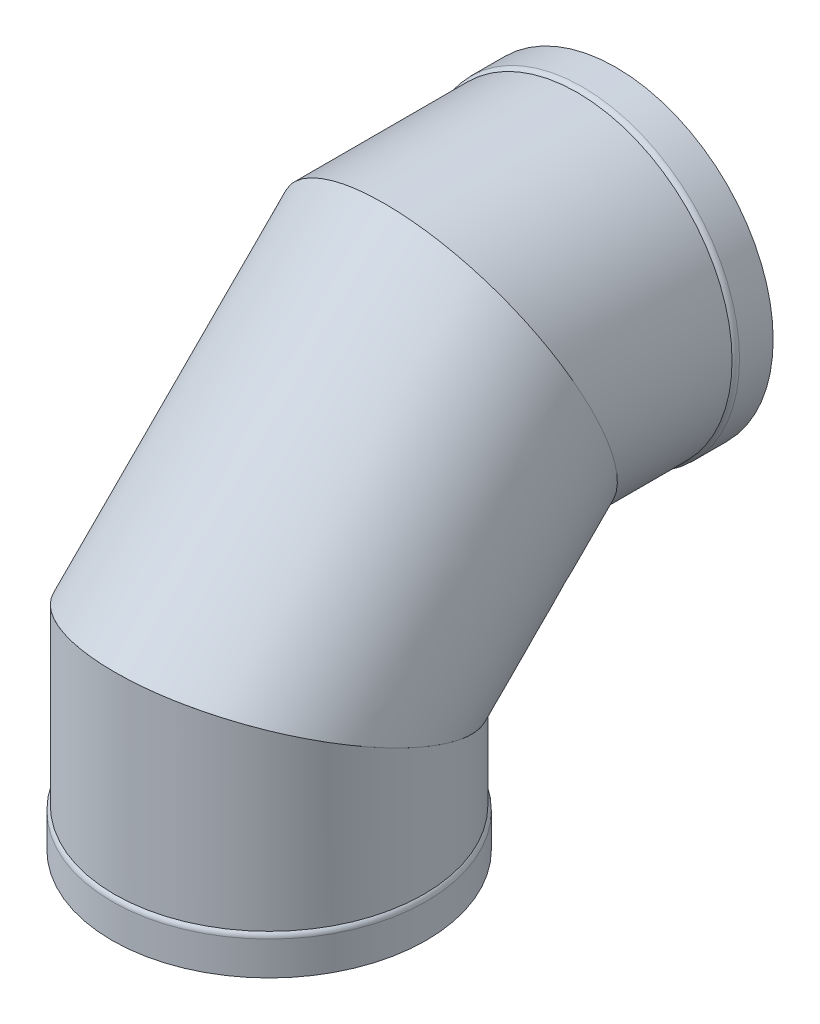
ISO-10303-21;
HEADER;
FILE_DESCRIPTION(('STEP AP214'),'2;1');
FILE_NAME('part.step','',(''),(''),'','','');
FILE_SCHEMA(('AUTOMOTIVE_DESIGN { 1 0 10303 214 1 1 1 1 }'));
ENDSEC;
DATA;
#1=APPLICATION_CONTEXT('core data for automotive mechanical design processes');
#2=APPLICATION_PROTOCOL_DEFINITION('international standard','automotive_design',2000,#1);
#3=PRODUCT_CONTEXT('',#1,'mechanical');
#4=PRODUCT('Part','Part','',(#3));
#5=PRODUCT_RELATED_PRODUCT_CATEGORY('part','',(#4));
#6=PRODUCT_DEFINITION_FORMATION('','',#4);
#7=PRODUCT_DEFINITION_CONTEXT('part definition',#1,'design');
#8=PRODUCT_DEFINITION('design','',#6,#7);
#9=PRODUCT_DEFINITION_SHAPE('','',#8);
#10=(LENGTH_UNIT() NAMED_UNIT(*) SI_UNIT(.MILLI.,.METRE.));
#11=(NAMED_UNIT(*) PLANE_ANGLE_UNIT() SI_UNIT($,.RADIAN.));
#12=(NAMED_UNIT(*) SI_UNIT($,.STERADIAN.) SOLID_ANGLE_UNIT());
#13=UNCERTAINTY_MEASURE_WITH_UNIT(LENGTH_MEASURE(1.E-05),#10,'distance_accuracy_value','');
#14=(GEOMETRIC_REPRESENTATION_CONTEXT(3) GLOBAL_UNCERTAINTY_ASSIGNED_CONTEXT((#13)) GLOBAL_UNIT_ASSIGNED_CONTEXT((#10,
#11,#12)) REPRESENTATION_CONTEXT('',''));
#15=CARTESIAN_POINT('',(0.,0.,0.));
#16=DIRECTION('',(0.,0.,1.));
#17=DIRECTION('',(1.,0.,0.));
#18=AXIS2_PLACEMENT_3D('',#15,#16,#17);
#19=CARTESIAN_POINT('',(0.,683.306549559583,-355.487799559582));
#20=DIRECTION('',(0.,-0.386660790118356,0.922222008729486));
#21=DIRECTION('',(0.,-0.922222008729486,-0.386660790118356));
#22=AXIS2_PLACEMENT_3D('',#19,#20,#21);
#23=PLANE('',#22);
#24=CARTESIAN_POINT('',(0.,683.306549559583,-355.487799559582));
#25=DIRECTION('',(0.,-0.386660790118356,0.922222008729486));
#26=DIRECTION('',(0.,-0.922222008729486,-0.386660790118356));
#27=AXIS2_PLACEMENT_3D('',#24,#25,#26);
#28=ELLIPSE('',#27,325.341942785936,300.0375);
#29=CARTESIAN_POINT('',(0.,383.269049559584,-481.284772215833));
#30=VERTEX_POINT('',#29);
#31=EDGE_CURVE('E90',#30,#30,#28,.T.);
#32=ORIENTED_EDGE('',*,*,#31,.T.);
#33=EDGE_LOOP('',(#32));
#34=FACE_BOUND('',#33,.T.);
#35=CARTESIAN_POINT('',(0.,683.306549559583,-355.487799559582));
#36=DIRECTION('',(0.,-0.386660790118356,0.922222008729486));
#37=DIRECTION('',(0.,-0.922222008729486,-0.386660790118356));
#38=AXIS2_PLACEMENT_3D('',#35,#36,#37);
#39=ELLIPSE('',#38,330.506100607935,304.8);
#40=CARTESIAN_POINT('',(0.,378.506549559584,-483.281549559583));
#41=VERTEX_POINT('',#40);
#42=EDGE_CURVE('E12',#41,#41,#39,.T.);
#43=ORIENTED_EDGE('',*,*,#42,.F.);
#44=EDGE_LOOP('',(#43));
#45=FACE_BOUND('',#44,.T.);
#46=ADVANCED_FACE('F73',(#34,#45),#23,.F.);
#47=CARTESIAN_POINT('',(0.,327.81875,0.));
#48=DIRECTION('',(0.,0.922222008729488,-0.386660790118353));
#49=DIRECTION('',(0.,0.386660790118353,0.922222008729488));
#50=AXIS2_PLACEMENT_3D('',#47,#48,#49);
#51=PLANE('',#50);
#52=CARTESIAN_POINT('',(0.,327.81875,0.));
#53=DIRECTION('',(0.,0.922222008729488,-0.386660790118353));
#54=DIRECTION('',(0.,-0.386660790118353,-0.922222008729488));
#55=AXIS2_PLACEMENT_3D('',#52,#53,#54);
#56=ELLIPSE('',#55,325.341942785936,300.0375);
#57=CARTESIAN_POINT('',(0.,202.02177734375,-300.0375));
#58=VERTEX_POINT('',#57);
#59=EDGE_CURVE('E104',#58,#58,#56,.T.);
#60=ORIENTED_EDGE('',*,*,#59,.T.);
#61=EDGE_LOOP('',(#60));
#62=FACE_BOUND('',#61,.T.);
#63=CARTESIAN_POINT('',(0.,327.81875,0.));
#64=DIRECTION('',(0.,0.922222008729488,-0.386660790118353));
#65=DIRECTION('',(0.,-0.386660790118353,-0.922222008729488));
#66=AXIS2_PLACEMENT_3D('',#63,#64,#65);
#67=ELLIPSE('',#66,330.506100607935,304.8);
#68=CARTESIAN_POINT('',(0.,200.025,-304.8));
#69=VERTEX_POINT('',#68);
#70=EDGE_CURVE('E82',#69,#69,#67,.T.);
#71=ORIENTED_EDGE('',*,*,#70,.F.);
#72=EDGE_LOOP('',(#71));
#73=FACE_BOUND('',#72,.T.);
#74=ADVANCED_FACE('F112',(#62,#73),#51,.F.);
#75=CARTESIAN_POINT('',(0.0381953964425871,455.612498996605,304.799997606811));
#76=CARTESIAN_POINT('',(0.122755309676878,988.106524840313,-227.69405992365));
#77=CARTESIAN_POINT('',(609.638190610064,455.580470565214,304.723606813925));
#78=CARTESIAN_POINT('',(609.722705871138,987.86101422096,-227.796995365618));
#79=CARTESIAN_POINT('',(609.561799817178,199.992972572002,-304.876388399696));
#80=CARTESIAN_POINT('',(609.477195251784,378.261063659499,-483.384474637483));
#81=CARTESIAN_POINT('',(-0.0381953964427598,200.025001003395,-304.799997606811));
#82=CARTESIAN_POINT('',(-0.122755309676916,378.506574278853,-483.281539195514));
#83=CARTESIAN_POINT('',(-609.638190610064,200.057029434787,-304.723606813925));
#84=CARTESIAN_POINT('',(-609.722705871138,378.752084898207,-483.178603753546));
#85=CARTESIAN_POINT('',(-609.561799817178,455.644527427998,304.876388399696));
#86=CARTESIAN_POINT('',(-609.477195251784,988.352035459667,-227.591124481681));
#87=CARTESIAN_POINT('',(0.0381953964425871,455.612498996605,304.799997606811));
#88=CARTESIAN_POINT('',(0.122755309676878,988.106524840313,-227.69405992365));
#89=(BOUNDED_SURFACE() B_SPLINE_SURFACE(3,1,((#75,#76),(#77,#78),(#79,#80),(#81,#82),(#83,#84),
(#85,#86),(#87,#88)),.UNSPECIFIED.,.T.,.F.,.F.) B_SPLINE_SURFACE_WITH_KNOTS((4,3,4),(2,2),(0.,
0.5,1.),(0.,1.),.UNSPECIFIED.) GEOMETRIC_REPRESENTATION_ITEM() RATIONAL_B_SPLINE_SURFACE(((1.,
1.),(0.333333333333333,0.333333333333333),(0.333333333333333,0.333333333333333),(1.,1.),
(0.333333333333333,0.333333333333333),(0.333333333333333,0.333333333333333),(1.,1.))) REPRESENTATION_ITEM('') SURFACE());
#90=ORIENTED_EDGE('',*,*,#70,.T.);
#91=EDGE_LOOP('',(#90));
#92=FACE_BOUND('',#91,.T.);
#93=ORIENTED_EDGE('',*,*,#42,.T.);
#94=EDGE_LOOP('',(#93));
#95=FACE_BOUND('',#94,.T.);
#96=ADVANCED_FACE('F132',(#92,#95),#89,.T.);
#97=CARTESIAN_POINT('',(0.,202.02177734375,-300.0375));
#98=CARTESIAN_POINT('',(0.,383.269049559584,-481.284772215833));
#99=CARTESIAN_POINT('',(-600.075,202.02177734375,-300.0375));
#100=CARTESIAN_POINT('',(-600.075,383.269049559584,-481.284772215833));
#101=CARTESIAN_POINT('',(-600.075,453.61572265625,300.0375));
#102=CARTESIAN_POINT('',(-600.075,983.344049559583,-229.690826903331));
#103=CARTESIAN_POINT('',(0.,453.61572265625,300.0375));
#104=CARTESIAN_POINT('',(0.,983.344049559583,-229.690826903331));
#105=CARTESIAN_POINT('',(600.075,453.61572265625,300.0375));
#106=CARTESIAN_POINT('',(600.075,983.344049559583,-229.690826903331));
#107=CARTESIAN_POINT('',(600.075,202.02177734375,-300.0375));
#108=CARTESIAN_POINT('',(600.075,383.269049559584,-481.284772215833));
#109=CARTESIAN_POINT('',(0.,202.02177734375,-300.0375));
#110=CARTESIAN_POINT('',(0.,383.269049559584,-481.284772215833));
#111=(BOUNDED_SURFACE() B_SPLINE_SURFACE(3,1,((#97,#98),(#99,#100),(#101,#102),(#103,#104),
(#105,#106),(#107,#108),(#109,#110)),.UNSPECIFIED.,.T.,.F.,.F.) B_SPLINE_SURFACE_WITH_KNOTS((4,
3,4),(2,2),(0.,0.5,1.),(0.,1.),
.UNSPECIFIED.) GEOMETRIC_REPRESENTATION_ITEM() RATIONAL_B_SPLINE_SURFACE(((1.,1.),
(0.333333333333333,0.333333333333333),(0.333333333333333,0.333333333333333),(1.,1.),
(0.333333333333333,0.333333333333333),(0.333333333333333,0.333333333333333),(1.,1.))) REPRESENTATION_ITEM('') SURFACE());
#112=ORIENTED_EDGE('',*,*,#59,.F.);
#113=EDGE_LOOP('',(#112));
#114=FACE_BOUND('',#113,.T.);
#115=ORIENTED_EDGE('',*,*,#31,.F.);
#116=EDGE_LOOP('',(#115));
#117=FACE_BOUND('',#116,.T.);
#118=ADVANCED_FACE('F133',(#114,#117),#111,.F.);
#119=CLOSED_SHELL('',(#46,#74,#96,#118));
#120=MANIFOLD_SOLID_BREP('B2',#119);
#121=CARTESIAN_POINT('',(0.,683.306549559584,-735.42034266303));
#122=DIRECTION('',(0.,0.,-1.));
#123=DIRECTION('',(0.,-1.,0.));
#124=AXIS2_PLACEMENT_3D('',#121,#122,#123);
#125=CYLINDRICAL_SURFACE('',#124,304.8);
#126=CARTESIAN_POINT('',(0.,683.306549559584,-607.106549559582));
#127=DIRECTION('',(0.,0.,1.));
#128=DIRECTION('',(0.,-1.,0.));
#129=AXIS2_PLACEMENT_3D('',#126,#127,#128);
#130=CIRCLE('',#129,304.8);
#131=CARTESIAN_POINT('',(0.,378.506549559584,-607.106549559583));
#132=VERTEX_POINT('',#131);
#133=EDGE_CURVE('E273',#132,#132,#130,.T.);
#134=ORIENTED_EDGE('',*,*,#133,.T.);
#135=EDGE_LOOP('',(#134));
#136=FACE_BOUND('',#135,.T.);
#137=CARTESIAN_POINT('',(0.,683.306549559583,-355.487799559582));
#138=DIRECTION('',(0.,-0.386660790118356,0.922222008729486));
#139=DIRECTION('',(0.,-0.922222008729486,-0.386660790118356));
#140=AXIS2_PLACEMENT_3D('',#137,#138,#139);
#141=ELLIPSE('',#140,330.506100607935,304.8);
#142=CARTESIAN_POINT('',(0.,378.506549559583,-483.281549559583));
#143=VERTEX_POINT('',#142);
#144=EDGE_CURVE('E285',#143,#143,#141,.T.);
#145=ORIENTED_EDGE('',*,*,#144,.F.);
#146=EDGE_LOOP('',(#145));
#147=FACE_BOUND('',#146,.T.);
#148=ADVANCED_FACE('F259',(#136,#147),#125,.T.);
#149=CARTESIAN_POINT('',(0.,683.306549559584,-735.42034266303));
#150=DIRECTION('',(0.,0.,-1.));
#151=DIRECTION('',(0.,-1.,0.));
#152=AXIS2_PLACEMENT_3D('',#149,#150,#151);
#153=CYLINDRICAL_SURFACE('',#152,309.5625);
#154=CARTESIAN_POINT('',(0.,683.306549559584,-617.020483882039));
#155=DIRECTION('',(0.,0.,1.));
#156=DIRECTION('',(0.,-1.,0.));
#157=AXIS2_PLACEMENT_3D('',#154,#155,#156);
#158=CIRCLE('',#157,309.5625);
#159=CARTESIAN_POINT('',(0.,373.744049559584,-617.02048388204));
#160=VERTEX_POINT('',#159);
#161=EDGE_CURVE('E267',#160,#160,#158,.F.);
#162=ORIENTED_EDGE('',*,*,#161,.T.);
#163=EDGE_LOOP('',(#162));
#164=FACE_BOUND('',#163,.T.);
#165=CARTESIAN_POINT('',(0.,683.306549559584,-683.306549559582));
#166=DIRECTION('',(0.,0.,1.));
#167=DIRECTION('',(0.,-1.,0.));
#168=AXIS2_PLACEMENT_3D('',#165,#166,#167);
#169=CIRCLE('',#168,309.5625);
#170=CARTESIAN_POINT('',(0.,373.744049559584,-683.306549559583));
#171=VERTEX_POINT('',#170);
#172=EDGE_CURVE('E279',#171,#171,#169,.T.);
#173=ORIENTED_EDGE('',*,*,#172,.T.);
#174=EDGE_LOOP('',(#173));
#175=FACE_BOUND('',#174,.T.);
#176=ADVANCED_FACE('F306',(#164,#175),#153,.T.);
#177=CARTESIAN_POINT('',(0.,992.869049559584,-683.306549559581));
#178=DIRECTION('',(0.,0.,1.));
#179=DIRECTION('',(0.,1.,0.));
#180=AXIS2_PLACEMENT_3D('',#177,#178,#179);
#181=PLANE('',#180);
#182=CARTESIAN_POINT('',(0.,683.306549559584,-683.306549559582));
#183=DIRECTION('',(0.,0.,1.));
#184=DIRECTION('',(0.,-1.,0.));
#185=AXIS2_PLACEMENT_3D('',#182,#183,#184);
#186=CIRCLE('',#185,304.8);
#187=CARTESIAN_POINT('',(0.,378.506549559584,-683.306549559583));
#188=VERTEX_POINT('',#187);
#189=EDGE_CURVE('E290',#188,#188,#186,.T.);
#190=ORIENTED_EDGE('',*,*,#189,.T.);
#191=EDGE_LOOP('',(#190));
#192=FACE_BOUND('',#191,.T.);
#193=ORIENTED_EDGE('',*,*,#172,.F.);
#194=EDGE_LOOP('',(#193));
#195=FACE_BOUND('',#194,.T.);
#196=ADVANCED_FACE('F312',(#192,#195),#181,.F.);
#197=CARTESIAN_POINT('',(0.,683.306549559584,-735.42034266303));
#198=DIRECTION('',(0.,0.,-1.));
#199=DIRECTION('',(0.,-1.,0.));
#200=AXIS2_PLACEMENT_3D('',#197,#198,#199);
#201=CYLINDRICAL_SURFACE('',#200,304.8);
#202=CARTESIAN_POINT('',(0.,683.306549559584,-621.782983882039));
#203=DIRECTION('',(0.,0.,1.));
#204=DIRECTION('',(0.,-1.,0.));
#205=AXIS2_PLACEMENT_3D('',#202,#203,#204);
#206=CIRCLE('',#205,304.8);
#207=CARTESIAN_POINT('',(0.,378.506549559584,-621.78298388204));
#208=VERTEX_POINT('',#207);
#209=EDGE_CURVE('E72',#208,#208,#206,.T.);
#210=ORIENTED_EDGE('',*,*,#209,.T.);
#211=EDGE_LOOP('',(#210));
#212=FACE_BOUND('',#211,.T.);
#213=ORIENTED_EDGE('',*,*,#189,.F.);
#214=EDGE_LOOP('',(#213));
#215=FACE_BOUND('',#214,.T.);
#216=ADVANCED_FACE('F331',(#212,#215),#201,.F.);
#217=CARTESIAN_POINT('',(0.,683.306549559584,-735.42034266303));
#218=DIRECTION('',(0.,0.,-1.));
#219=DIRECTION('',(0.,-1.,0.));
#220=AXIS2_PLACEMENT_3D('',#217,#218,#219);
#221=CYLINDRICAL_SURFACE('',#220,300.0375);
#222=CARTESIAN_POINT('',(0.,683.306549559583,-355.487799559582));
#223=DIRECTION('',(0.,-0.386660790118356,0.922222008729486));
#224=DIRECTION('',(0.,-0.922222008729486,-0.386660790118356));
#225=AXIS2_PLACEMENT_3D('',#222,#223,#224);
#226=ELLIPSE('',#225,325.341942785936,300.0375);
#227=CARTESIAN_POINT('',(0.,383.269049559583,-481.284772215833));
#228=VERTEX_POINT('',#227);
#229=EDGE_CURVE('E282',#228,#228,#226,.F.);
#230=ORIENTED_EDGE('',*,*,#229,.F.);
#231=EDGE_LOOP('',(#230));
#232=FACE_BOUND('',#231,.T.);
#233=CARTESIAN_POINT('',(0.,683.306549559584,-611.869049559582));
#234=DIRECTION('',(0.,0.,1.));
#235=DIRECTION('',(0.,-1.,0.));
#236=AXIS2_PLACEMENT_3D('',#233,#234,#235);
#237=CIRCLE('',#236,300.0375);
#238=CARTESIAN_POINT('',(0.,383.269049559584,-611.869049559583));
#239=VERTEX_POINT('',#238);
#240=EDGE_CURVE('E294',#239,#239,#237,.T.);
#241=ORIENTED_EDGE('',*,*,#240,.F.);
#242=EDGE_LOOP('',(#241));
#243=FACE_BOUND('',#242,.T.);
#244=ADVANCED_FACE('F323',(#232,#243),#221,.F.);
#245=CARTESIAN_POINT('',(-309.5625,988.106549559582,-227.694049559581));
#246=DIRECTION('',(0.,0.386660790118356,-0.922222008729486));
#247=DIRECTION('',(0.,-0.922222008729486,-0.386660790118356));
#248=AXIS2_PLACEMENT_3D('',#245,#246,#247);
#249=PLANE('',#248);
#250=ORIENTED_EDGE('',*,*,#229,.T.);
#251=EDGE_LOOP('',(#250));
#252=FACE_BOUND('',#251,.T.);
#253=ORIENTED_EDGE('',*,*,#144,.T.);
#254=EDGE_LOOP('',(#253));
#255=FACE_BOUND('',#254,.T.);
#256=ADVANCED_FACE('F303',(#252,#255),#249,.F.);
#257=CARTESIAN_POINT('',(0.,683.306549559584,-617.020483882039));
#258=DIRECTION('',(0.,0.,1.));
#259=DIRECTION('',(0.,-1.,0.));
#260=AXIS2_PLACEMENT_3D('',#257,#258,#259);
#261=TOROIDAL_SURFACE('',#260,296.8625,12.7);
#262=ORIENTED_EDGE('',*,*,#161,.F.);
#263=EDGE_LOOP('',(#262));
#264=FACE_BOUND('',#263,.T.);
#265=ORIENTED_EDGE('',*,*,#133,.F.);
#266=EDGE_LOOP('',(#265));
#267=FACE_BOUND('',#266,.T.);
#268=ADVANCED_FACE('F315',(#264,#267),#261,.T.);
#269=CARTESIAN_POINT('',(0.,683.306549559584,-621.782983882039));
#270=DIRECTION('',(0.,0.,1.));
#271=DIRECTION('',(0.,-1.,0.));
#272=AXIS2_PLACEMENT_3D('',#269,#270,#271);
#273=TOROIDAL_SURFACE('',#272,292.1,12.7);
#274=ORIENTED_EDGE('',*,*,#240,.T.);
#275=EDGE_LOOP('',(#274));
#276=FACE_BOUND('',#275,.T.);
#277=ORIENTED_EDGE('',*,*,#209,.F.);
#278=EDGE_LOOP('',(#277));
#279=FACE_BOUND('',#278,.T.);
#280=ADVANCED_FACE('F261',(#276,#279),#273,.F.);
#281=CLOSED_SHELL('',(#148,#176,#196,#216,#244,#256,#268,#280));
#282=MANIFOLD_SOLID_BREP('B7',#281);
#283=CARTESIAN_POINT('',(0.,-52.1137931034483,0.));
#284=DIRECTION('',(0.,-1.,0.));
#285=DIRECTION('',(0.,0.,-1.));
#286=AXIS2_PLACEMENT_3D('',#283,#284,#285);
#287=CYLINDRICAL_SURFACE('',#286,304.8);
#288=CARTESIAN_POINT('',(0.,76.2,0.));
#289=DIRECTION('',(0.,-1.,0.));
#290=DIRECTION('',(0.,0.,-1.));
#291=AXIS2_PLACEMENT_3D('',#288,#289,#290);
#292=CIRCLE('',#291,304.8);
#293=CARTESIAN_POINT('',(0.,76.2,-304.8));
#294=VERTEX_POINT('',#293);
#295=EDGE_CURVE('E426',#294,#294,#292,.T.);
#296=ORIENTED_EDGE('',*,*,#295,.F.);
#297=EDGE_LOOP('',(#296));
#298=FACE_BOUND('',#297,.T.);
#299=CARTESIAN_POINT('',(0.,327.81875,0.));
#300=DIRECTION('',(0.,-0.922222008729488,0.386660790118353));
#301=DIRECTION('',(0.,-0.386660790118353,-0.922222008729488));
#302=AXIS2_PLACEMENT_3D('',#299,#300,#301);
#303=ELLIPSE('',#302,330.506100607935,304.8);
#304=CARTESIAN_POINT('',(0.,200.025,-304.8));
#305=VERTEX_POINT('',#304);
#306=EDGE_CURVE('E438',#305,#305,#303,.T.);
#307=ORIENTED_EDGE('',*,*,#306,.T.);
#308=EDGE_LOOP('',(#307));
#309=FACE_BOUND('',#308,.T.);
#310=ADVANCED_FACE('F412',(#298,#309),#287,.T.);
#311=CARTESIAN_POINT('',(0.,-52.1137931034483,0.));
#312=DIRECTION('',(0.,-1.,0.));
#313=DIRECTION('',(0.,0.,-1.));
#314=AXIS2_PLACEMENT_3D('',#311,#312,#313);
#315=CYLINDRICAL_SURFACE('',#314,309.5625);
#316=CARTESIAN_POINT('',(0.,66.2860656775425,0.));
#317=DIRECTION('',(0.,1.,0.));
#318=DIRECTION('',(0.,0.,1.));
#319=AXIS2_PLACEMENT_3D('',#316,#317,#318);
#320=CIRCLE('',#319,309.5625);
#321=CARTESIAN_POINT('',(0.,66.2860656775425,309.5625));
#322=VERTEX_POINT('',#321);
#323=EDGE_CURVE('E258',#322,#322,#320,.F.);
#324=ORIENTED_EDGE('',*,*,#323,.T.);
#325=EDGE_LOOP('',(#324));
#326=FACE_BOUND('',#325,.T.);
#327=CARTESIAN_POINT('',(0.,0.,0.));
#328=DIRECTION('',(0.,-1.,0.));
#329=DIRECTION('',(0.,0.,-1.));
#330=AXIS2_PLACEMENT_3D('',#327,#328,#329);
#331=CIRCLE('',#330,309.5625);
#332=CARTESIAN_POINT('',(0.,0.,-309.5625));
#333=VERTEX_POINT('',#332);
#334=EDGE_CURVE('E432',#333,#333,#331,.T.);
#335=ORIENTED_EDGE('',*,*,#334,.F.);
#336=EDGE_LOOP('',(#335));
#337=FACE_BOUND('',#336,.T.);
#338=ADVANCED_FACE('F473',(#326,#337),#315,.T.);
#339=CARTESIAN_POINT('',(0.,0.,309.5625));
#340=DIRECTION('',(0.,1.,0.));
#341=DIRECTION('',(0.,0.,1.));
#342=AXIS2_PLACEMENT_3D('',#339,#340,#341);
#343=PLANE('',#342);
#344=CARTESIAN_POINT('',(0.,0.,0.));
#345=DIRECTION('',(0.,-1.,0.));
#346=DIRECTION('',(0.,0.,-1.));
#347=AXIS2_PLACEMENT_3D('',#344,#345,#346);
#348=CIRCLE('',#347,304.8);
#349=CARTESIAN_POINT('',(0.,0.,-304.8));
#350=VERTEX_POINT('',#349);
#351=EDGE_CURVE('E443',#350,#350,#348,.T.);
#352=ORIENTED_EDGE('',*,*,#351,.F.);
#353=EDGE_LOOP('',(#352));
#354=FACE_BOUND('',#353,.T.);
#355=ORIENTED_EDGE('',*,*,#334,.T.);
#356=EDGE_LOOP('',(#355));
#357=FACE_BOUND('',#356,.T.);
#358=ADVANCED_FACE('F479',(#354,#357),#343,.F.);
#359=CARTESIAN_POINT('',(0.,-52.1137931034483,0.));
#360=DIRECTION('',(0.,-1.,0.));
#361=DIRECTION('',(0.,0.,-1.));
#362=AXIS2_PLACEMENT_3D('',#359,#360,#361);
#363=CYLINDRICAL_SURFACE('',#362,304.8);
#364=CARTESIAN_POINT('',(0.,61.5235656775425,0.));
#365=DIRECTION('',(0.,1.,0.));
#366=DIRECTION('',(0.,0.,1.));
#367=AXIS2_PLACEMENT_3D('',#364,#365,#366);
#368=CIRCLE('',#367,304.8);
#369=CARTESIAN_POINT('',(0.,61.5235656775425,304.8));
#370=VERTEX_POINT('',#369);
#371=EDGE_CURVE('E420',#370,#370,#368,.T.);
#372=ORIENTED_EDGE('',*,*,#371,.T.);
#373=EDGE_LOOP('',(#372));
#374=FACE_BOUND('',#373,.T.);
#375=ORIENTED_EDGE('',*,*,#351,.T.);
#376=EDGE_LOOP('',(#375));
#377=FACE_BOUND('',#376,.T.);
#378=ADVANCED_FACE('F468',(#374,#377),#363,.F.);
#379=CARTESIAN_POINT('',(0.,-52.1137931034483,0.));
#380=DIRECTION('',(0.,-1.,0.));
#381=DIRECTION('',(0.,0.,-1.));
#382=AXIS2_PLACEMENT_3D('',#379,#380,#381);
#383=CYLINDRICAL_SURFACE('',#382,300.0375);
#384=CARTESIAN_POINT('',(0.,327.81875,0.));
#385=DIRECTION('',(0.,-0.922222008729488,0.386660790118353));
#386=DIRECTION('',(0.,-0.386660790118353,-0.922222008729488));
#387=AXIS2_PLACEMENT_3D('',#384,#385,#386);
#388=ELLIPSE('',#387,325.341942785936,300.0375);
#389=CARTESIAN_POINT('',(0.,202.02177734375,-300.0375));
#390=VERTEX_POINT('',#389);
#391=EDGE_CURVE('E435',#390,#390,#388,.F.);
#392=ORIENTED_EDGE('',*,*,#391,.T.);
#393=EDGE_LOOP('',(#392));
#394=FACE_BOUND('',#393,.T.);
#395=CARTESIAN_POINT('',(0.,71.4375,0.));
#396=DIRECTION('',(0.,-1.,0.));
#397=DIRECTION('',(0.,0.,-1.));
#398=AXIS2_PLACEMENT_3D('',#395,#396,#397);
#399=CIRCLE('',#398,300.0375);
#400=CARTESIAN_POINT('',(0.,71.4375,-300.0375));
#401=VERTEX_POINT('',#400);
#402=EDGE_CURVE('E447',#401,#401,#399,.T.);
#403=ORIENTED_EDGE('',*,*,#402,.T.);
#404=EDGE_LOOP('',(#403));
#405=FACE_BOUND('',#404,.T.);
#406=ADVANCED_FACE('F460',(#394,#405),#383,.F.);
#407=CARTESIAN_POINT('',(-309.5625,455.6125,304.8));
#408=DIRECTION('',(0.,-0.922222008729488,0.386660790118353));
#409=DIRECTION('',(0.,-0.386660790118353,-0.922222008729488));
#410=AXIS2_PLACEMENT_3D('',#407,#408,#409);
#411=PLANE('',#410);
#412=ORIENTED_EDGE('',*,*,#391,.F.);
#413=EDGE_LOOP('',(#412));
#414=FACE_BOUND('',#413,.T.);
#415=ORIENTED_EDGE('',*,*,#306,.F.);
#416=EDGE_LOOP('',(#415));
#417=FACE_BOUND('',#416,.T.);
#418=ADVANCED_FACE('F457',(#414,#417),#411,.F.);
#419=CARTESIAN_POINT('',(0.,61.5235656775425,0.));
#420=DIRECTION('',(0.,1.,0.));
#421=DIRECTION('',(0.,0.,1.));
#422=AXIS2_PLACEMENT_3D('',#419,#420,#421);
#423=TOROIDAL_SURFACE('',#422,292.1,12.7);
#424=ORIENTED_EDGE('',*,*,#371,.F.);
#425=EDGE_LOOP('',(#424));
#426=FACE_BOUND('',#425,.T.);
#427=ORIENTED_EDGE('',*,*,#402,.F.);
#428=EDGE_LOOP('',(#427));
#429=FACE_BOUND('',#428,.T.);
#430=ADVANCED_FACE('F459',(#426,#429),#423,.F.);
#431=CARTESIAN_POINT('',(0.,66.2860656775425,0.));
#432=DIRECTION('',(0.,1.,0.));
#433=DIRECTION('',(0.,0.,1.));
#434=AXIS2_PLACEMENT_3D('',#431,#432,#433);
#435=TOROIDAL_SURFACE('',#434,296.8625,12.7);
#436=ORIENTED_EDGE('',*,*,#295,.T.);
#437=EDGE_LOOP('',(#436));
#438=FACE_BOUND('',#437,.T.);
#439=ORIENTED_EDGE('',*,*,#323,.F.);
#440=EDGE_LOOP('',(#439));
#441=FACE_BOUND('',#440,.T.);
#442=ADVANCED_FACE('F414',(#438,#441),#435,.T.);
#443=CLOSED_SHELL('',(#310,#338,#358,#378,#406,#418,#430,#442));
#444=MANIFOLD_SOLID_BREP('B67',#443);
#445=ADVANCED_BREP_SHAPE_REPRESENTATION('',(#18,#120,#282,#444),#14);
#446=SHAPE_DEFINITION_REPRESENTATION(#9,#445);
ENDSEC;
END-ISO-10303-21;
